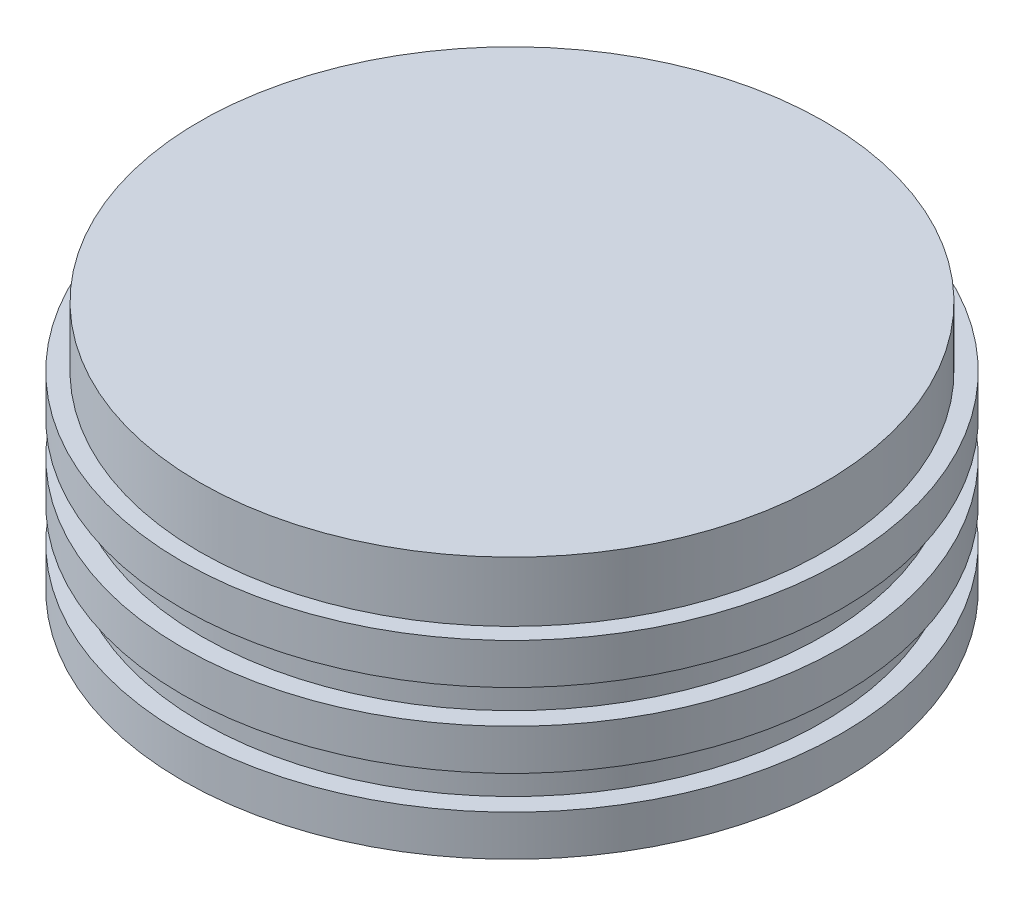
ISO-10303-21;
HEADER;
FILE_DESCRIPTION(('STEP AP214'),'2;1');
FILE_NAME('part.step','',(''),(''),'','','');
FILE_SCHEMA(('AUTOMOTIVE_DESIGN { 1 0 10303 214 1 1 1 1 }'));
ENDSEC;
DATA;
#1=APPLICATION_CONTEXT('core data for automotive mechanical design processes');
#2=APPLICATION_PROTOCOL_DEFINITION('international standard','automotive_design',2000,#1);
#3=PRODUCT_CONTEXT('',#1,'mechanical');
#4=PRODUCT('Part','Part','',(#3));
#5=PRODUCT_RELATED_PRODUCT_CATEGORY('part','',(#4));
#6=PRODUCT_DEFINITION_FORMATION('','',#4);
#7=PRODUCT_DEFINITION_CONTEXT('part definition',#1,'design');
#8=PRODUCT_DEFINITION('design','',#6,#7);
#9=PRODUCT_DEFINITION_SHAPE('','',#8);
#10=(LENGTH_UNIT() NAMED_UNIT(*) SI_UNIT(.MILLI.,.METRE.));
#11=(NAMED_UNIT(*) PLANE_ANGLE_UNIT() SI_UNIT($,.RADIAN.));
#12=(NAMED_UNIT(*) SI_UNIT($,.STERADIAN.) SOLID_ANGLE_UNIT());
#13=UNCERTAINTY_MEASURE_WITH_UNIT(LENGTH_MEASURE(1.E-05),#10,'distance_accuracy_value','');
#14=(GEOMETRIC_REPRESENTATION_CONTEXT(3) GLOBAL_UNCERTAINTY_ASSIGNED_CONTEXT((#13)) GLOBAL_UNIT_ASSIGNED_CONTEXT((#10,
#11,#12)) REPRESENTATION_CONTEXT('',''));
#15=CARTESIAN_POINT('',(0.,0.,0.));
#16=DIRECTION('',(0.,0.,1.));
#17=DIRECTION('',(1.,0.,0.));
#18=AXIS2_PLACEMENT_3D('',#15,#16,#17);
#19=CARTESIAN_POINT('',(-34.8996,0.,0.));
#20=DIRECTION('',(0.,1.,0.));
#21=DIRECTION('',(0.,0.,1.));
#22=AXIS2_PLACEMENT_3D('',#19,#20,#21);
#23=PLANE('',#22);
#24=CARTESIAN_POINT('',(0.,0.,0.));
#25=DIRECTION('',(0.,-1.,0.));
#26=DIRECTION('',(0.,0.,-1.));
#27=AXIS2_PLACEMENT_3D('',#24,#25,#26);
#28=CIRCLE('',#27,3.96875);
#29=CARTESIAN_POINT('',(0.,0.,-3.96875));
#30=VERTEX_POINT('',#29);
#31=EDGE_CURVE('E58',#30,#30,#28,.T.);
#32=ORIENTED_EDGE('',*,*,#31,.F.);
#33=EDGE_LOOP('',(#32));
#34=FACE_BOUND('',#33,.T.);
#35=CARTESIAN_POINT('',(0.,0.,0.));
#36=DIRECTION('',(0.,-1.,0.));
#37=DIRECTION('',(0.,0.,-1.));
#38=AXIS2_PLACEMENT_3D('',#35,#36,#37);
#39=CIRCLE('',#38,34.8996);
#40=CARTESIAN_POINT('',(0.,0.,-34.8996));
#41=VERTEX_POINT('',#40);
#42=EDGE_CURVE('E57',#41,#41,#39,.T.);
#43=ORIENTED_EDGE('',*,*,#42,.T.);
#44=EDGE_LOOP('',(#43));
#45=FACE_BOUND('',#44,.T.);
#46=ADVANCED_FACE('F38',(#34,#45),#23,.F.);
#47=CARTESIAN_POINT('',(0.,26.416,0.));
#48=DIRECTION('',(0.,-1.,0.));
#49=DIRECTION('',(0.,0.,-1.));
#50=AXIS2_PLACEMENT_3D('',#47,#48,#49);
#51=PLANE('',#50);
#52=CARTESIAN_POINT('',(0.,26.416,0.));
#53=DIRECTION('',(0.,-1.,0.));
#54=DIRECTION('',(0.,0.,-1.));
#55=AXIS2_PLACEMENT_3D('',#52,#53,#54);
#56=CIRCLE('',#55,33.0835);
#57=CARTESIAN_POINT('',(0.,26.416,-33.0835));
#58=VERTEX_POINT('',#57);
#59=EDGE_CURVE('E11',#58,#58,#56,.T.);
#60=ORIENTED_EDGE('',*,*,#59,.F.);
#61=EDGE_LOOP('',(#60));
#62=FACE_BOUND('',#61,.T.);
#63=ADVANCED_FACE('F99',(#62),#51,.F.);
#64=CARTESIAN_POINT('',(0.,0.,0.));
#65=DIRECTION('',(0.,-1.,0.));
#66=DIRECTION('',(0.,0.,-1.));
#67=AXIS2_PLACEMENT_3D('',#64,#65,#66);
#68=CYLINDRICAL_SURFACE('',#67,33.0835);
#69=CARTESIAN_POINT('',(0.,20.066,0.));
#70=DIRECTION('',(0.,-1.,0.));
#71=DIRECTION('',(0.,0.,-1.));
#72=AXIS2_PLACEMENT_3D('',#69,#70,#71);
#73=CIRCLE('',#72,33.0835);
#74=CARTESIAN_POINT('',(0.,20.066,-33.0835));
#75=VERTEX_POINT('',#74);
#76=EDGE_CURVE('E44',#75,#75,#73,.T.);
#77=ORIENTED_EDGE('',*,*,#76,.F.);
#78=EDGE_LOOP('',(#77));
#79=FACE_BOUND('',#78,.T.);
#80=ORIENTED_EDGE('',*,*,#59,.T.);
#81=EDGE_LOOP('',(#80));
#82=FACE_BOUND('',#81,.T.);
#83=ADVANCED_FACE('F96',(#79,#82),#68,.T.);
#84=CARTESIAN_POINT('',(-33.0835,20.066,0.));
#85=DIRECTION('',(0.,-1.,0.));
#86=DIRECTION('',(0.,0.,-1.));
#87=AXIS2_PLACEMENT_3D('',#84,#85,#86);
#88=PLANE('',#87);
#89=CARTESIAN_POINT('',(0.,20.066,0.));
#90=DIRECTION('',(0.,-1.,0.));
#91=DIRECTION('',(0.,0.,-1.));
#92=AXIS2_PLACEMENT_3D('',#89,#90,#91);
#93=CIRCLE('',#92,34.8996);
#94=CARTESIAN_POINT('',(0.,20.066,-34.8996));
#95=VERTEX_POINT('',#94);
#96=EDGE_CURVE('E89',#95,#95,#93,.T.);
#97=ORIENTED_EDGE('',*,*,#96,.F.);
#98=EDGE_LOOP('',(#97));
#99=FACE_BOUND('',#98,.T.);
#100=ORIENTED_EDGE('',*,*,#76,.T.);
#101=EDGE_LOOP('',(#100));
#102=FACE_BOUND('',#101,.T.);
#103=ADVANCED_FACE('F94',(#99,#102),#88,.F.);
#104=CARTESIAN_POINT('',(0.,0.,0.));
#105=DIRECTION('',(0.,-1.,0.));
#106=DIRECTION('',(0.,0.,-1.));
#107=AXIS2_PLACEMENT_3D('',#104,#105,#106);
#108=CYLINDRICAL_SURFACE('',#107,34.8996);
#109=CARTESIAN_POINT('',(0.,15.748,0.));
#110=DIRECTION('',(0.,-1.,0.));
#111=DIRECTION('',(0.,0.,-1.));
#112=AXIS2_PLACEMENT_3D('',#109,#110,#111);
#113=CIRCLE('',#112,34.8996);
#114=CARTESIAN_POINT('',(0.,15.748,-34.8996));
#115=VERTEX_POINT('',#114);
#116=EDGE_CURVE('E86',#115,#115,#113,.T.);
#117=ORIENTED_EDGE('',*,*,#116,.F.);
#118=EDGE_LOOP('',(#117));
#119=FACE_BOUND('',#118,.T.);
#120=ORIENTED_EDGE('',*,*,#96,.T.);
#121=EDGE_LOOP('',(#120));
#122=FACE_BOUND('',#121,.T.);
#123=ADVANCED_FACE('F111',(#119,#122),#108,.T.);
#124=CARTESIAN_POINT('',(-34.8996,15.748,0.));
#125=DIRECTION('',(0.,1.,0.));
#126=DIRECTION('',(0.,0.,1.));
#127=AXIS2_PLACEMENT_3D('',#124,#125,#126);
#128=PLANE('',#127);
#129=CARTESIAN_POINT('',(0.,15.748,0.));
#130=DIRECTION('',(0.,-1.,0.));
#131=DIRECTION('',(0.,0.,-1.));
#132=AXIS2_PLACEMENT_3D('',#129,#130,#131);
#133=CIRCLE('',#132,32.8676);
#134=CARTESIAN_POINT('',(0.,15.748,-32.8676));
#135=VERTEX_POINT('',#134);
#136=EDGE_CURVE('E83',#135,#135,#133,.T.);
#137=ORIENTED_EDGE('',*,*,#136,.F.);
#138=EDGE_LOOP('',(#137));
#139=FACE_BOUND('',#138,.T.);
#140=ORIENTED_EDGE('',*,*,#116,.T.);
#141=EDGE_LOOP('',(#140));
#142=FACE_BOUND('',#141,.T.);
#143=ADVANCED_FACE('F115',(#139,#142),#128,.F.);
#144=CARTESIAN_POINT('',(0.,0.,0.));
#145=DIRECTION('',(0.,-1.,0.));
#146=DIRECTION('',(0.,0.,-1.));
#147=AXIS2_PLACEMENT_3D('',#144,#145,#146);
#148=CYLINDRICAL_SURFACE('',#147,32.8676);
#149=CARTESIAN_POINT('',(0.,12.192,0.));
#150=DIRECTION('',(0.,-1.,0.));
#151=DIRECTION('',(0.,0.,-1.));
#152=AXIS2_PLACEMENT_3D('',#149,#150,#151);
#153=CIRCLE('',#152,32.8676);
#154=CARTESIAN_POINT('',(0.,12.192,-32.8676));
#155=VERTEX_POINT('',#154);
#156=EDGE_CURVE('E80',#155,#155,#153,.T.);
#157=ORIENTED_EDGE('',*,*,#156,.F.);
#158=EDGE_LOOP('',(#157));
#159=FACE_BOUND('',#158,.T.);
#160=ORIENTED_EDGE('',*,*,#136,.T.);
#161=EDGE_LOOP('',(#160));
#162=FACE_BOUND('',#161,.T.);
#163=ADVANCED_FACE('F119',(#159,#162),#148,.T.);
#164=CARTESIAN_POINT('',(-34.8996,12.192,0.));
#165=DIRECTION('',(0.,-1.,0.));
#166=DIRECTION('',(0.,0.,-1.));
#167=AXIS2_PLACEMENT_3D('',#164,#165,#166);
#168=PLANE('',#167);
#169=CARTESIAN_POINT('',(0.,12.192,0.));
#170=DIRECTION('',(0.,-1.,0.));
#171=DIRECTION('',(0.,0.,-1.));
#172=AXIS2_PLACEMENT_3D('',#169,#170,#171);
#173=CIRCLE('',#172,34.8996);
#174=CARTESIAN_POINT('',(0.,12.192,-34.8996));
#175=VERTEX_POINT('',#174);
#176=EDGE_CURVE('E77',#175,#175,#173,.T.);
#177=ORIENTED_EDGE('',*,*,#176,.F.);
#178=EDGE_LOOP('',(#177));
#179=FACE_BOUND('',#178,.T.);
#180=ORIENTED_EDGE('',*,*,#156,.T.);
#181=EDGE_LOOP('',(#180));
#182=FACE_BOUND('',#181,.T.);
#183=ADVANCED_FACE('F123',(#179,#182),#168,.F.);
#184=CARTESIAN_POINT('',(0.,0.,0.));
#185=DIRECTION('',(0.,-1.,0.));
#186=DIRECTION('',(0.,0.,-1.));
#187=AXIS2_PLACEMENT_3D('',#184,#185,#186);
#188=CYLINDRICAL_SURFACE('',#187,34.8996);
#189=CARTESIAN_POINT('',(0.,7.874,0.));
#190=DIRECTION('',(0.,-1.,0.));
#191=DIRECTION('',(0.,0.,-1.));
#192=AXIS2_PLACEMENT_3D('',#189,#190,#191);
#193=CIRCLE('',#192,34.8996);
#194=CARTESIAN_POINT('',(0.,7.874,-34.8996));
#195=VERTEX_POINT('',#194);
#196=EDGE_CURVE('E74',#195,#195,#193,.T.);
#197=ORIENTED_EDGE('',*,*,#196,.F.);
#198=EDGE_LOOP('',(#197));
#199=FACE_BOUND('',#198,.T.);
#200=ORIENTED_EDGE('',*,*,#176,.T.);
#201=EDGE_LOOP('',(#200));
#202=FACE_BOUND('',#201,.T.);
#203=ADVANCED_FACE('F127',(#199,#202),#188,.T.);
#204=CARTESIAN_POINT('',(-32.8676,7.874,0.));
#205=DIRECTION('',(0.,1.,0.));
#206=DIRECTION('',(0.,0.,1.));
#207=AXIS2_PLACEMENT_3D('',#204,#205,#206);
#208=PLANE('',#207);
#209=CARTESIAN_POINT('',(0.,7.874,0.));
#210=DIRECTION('',(0.,-1.,0.));
#211=DIRECTION('',(0.,0.,-1.));
#212=AXIS2_PLACEMENT_3D('',#209,#210,#211);
#213=CIRCLE('',#212,32.8676);
#214=CARTESIAN_POINT('',(0.,7.874,-32.8676));
#215=VERTEX_POINT('',#214);
#216=EDGE_CURVE('E71',#215,#215,#213,.T.);
#217=ORIENTED_EDGE('',*,*,#216,.F.);
#218=EDGE_LOOP('',(#217));
#219=FACE_BOUND('',#218,.T.);
#220=ORIENTED_EDGE('',*,*,#196,.T.);
#221=EDGE_LOOP('',(#220));
#222=FACE_BOUND('',#221,.T.);
#223=ADVANCED_FACE('F131',(#219,#222),#208,.F.);
#224=CARTESIAN_POINT('',(0.,0.,0.));
#225=DIRECTION('',(0.,-1.,0.));
#226=DIRECTION('',(0.,0.,-1.));
#227=AXIS2_PLACEMENT_3D('',#224,#225,#226);
#228=CYLINDRICAL_SURFACE('',#227,32.8676);
#229=CARTESIAN_POINT('',(0.,4.318,0.));
#230=DIRECTION('',(0.,-1.,0.));
#231=DIRECTION('',(0.,0.,-1.));
#232=AXIS2_PLACEMENT_3D('',#229,#230,#231);
#233=CIRCLE('',#232,32.8676);
#234=CARTESIAN_POINT('',(0.,4.318,-32.8676));
#235=VERTEX_POINT('',#234);
#236=EDGE_CURVE('E68',#235,#235,#233,.T.);
#237=ORIENTED_EDGE('',*,*,#236,.F.);
#238=EDGE_LOOP('',(#237));
#239=FACE_BOUND('',#238,.T.);
#240=ORIENTED_EDGE('',*,*,#216,.T.);
#241=EDGE_LOOP('',(#240));
#242=FACE_BOUND('',#241,.T.);
#243=ADVANCED_FACE('F135',(#239,#242),#228,.T.);
#244=CARTESIAN_POINT('',(-32.8676,4.318,0.));
#245=DIRECTION('',(0.,-1.,0.));
#246=DIRECTION('',(0.,0.,-1.));
#247=AXIS2_PLACEMENT_3D('',#244,#245,#246);
#248=PLANE('',#247);
#249=CARTESIAN_POINT('',(0.,4.318,0.));
#250=DIRECTION('',(0.,-1.,0.));
#251=DIRECTION('',(0.,0.,-1.));
#252=AXIS2_PLACEMENT_3D('',#249,#250,#251);
#253=CIRCLE('',#252,34.8996);
#254=CARTESIAN_POINT('',(0.,4.318,-34.8996));
#255=VERTEX_POINT('',#254);
#256=EDGE_CURVE('E61',#255,#255,#253,.T.);
#257=ORIENTED_EDGE('',*,*,#256,.F.);
#258=EDGE_LOOP('',(#257));
#259=FACE_BOUND('',#258,.T.);
#260=ORIENTED_EDGE('',*,*,#236,.T.);
#261=EDGE_LOOP('',(#260));
#262=FACE_BOUND('',#261,.T.);
#263=ADVANCED_FACE('F139',(#259,#262),#248,.F.);
#264=CARTESIAN_POINT('',(0.,0.,0.));
#265=DIRECTION('',(0.,-1.,0.));
#266=DIRECTION('',(0.,0.,-1.));
#267=AXIS2_PLACEMENT_3D('',#264,#265,#266);
#268=CYLINDRICAL_SURFACE('',#267,34.8996);
#269=ORIENTED_EDGE('',*,*,#42,.F.);
#270=EDGE_LOOP('',(#269));
#271=FACE_BOUND('',#270,.T.);
#272=ORIENTED_EDGE('',*,*,#256,.T.);
#273=EDGE_LOOP('',(#272));
#274=FACE_BOUND('',#273,.T.);
#275=ADVANCED_FACE('F51',(#271,#274),#268,.T.);
#276=CARTESIAN_POINT('',(0.,15.875,0.));
#277=DIRECTION('',(0.,-1.,0.));
#278=DIRECTION('',(0.,0.,-1.));
#279=AXIS2_PLACEMENT_3D('',#276,#277,#278);
#280=CONICAL_SURFACE('',#279,3.96875,1.02974425867665);
#281=CARTESIAN_POINT('',(0.,18.2596655817656,0.));
#282=VERTEX_POINT('',#281);
#283=VERTEX_LOOP('',#282);
#284=FACE_BOUND('',#283,.T.);
#285=CARTESIAN_POINT('',(0.,15.875,0.));
#286=DIRECTION('',(0.,-1.,0.));
#287=DIRECTION('',(0.,0.,-1.));
#288=AXIS2_PLACEMENT_3D('',#285,#286,#287);
#289=CIRCLE('',#288,3.96875);
#290=CARTESIAN_POINT('',(0.,15.875,-3.96875));
#291=VERTEX_POINT('',#290);
#292=EDGE_CURVE('E55',#291,#291,#289,.T.);
#293=ORIENTED_EDGE('',*,*,#292,.T.);
#294=EDGE_LOOP('',(#293));
#295=FACE_BOUND('',#294,.T.);
#296=ADVANCED_FACE('F47',(#284,#295),#280,.F.);
#297=CARTESIAN_POINT('',(0.,0.,0.));
#298=DIRECTION('',(0.,-1.,0.));
#299=DIRECTION('',(0.,0.,-1.));
#300=AXIS2_PLACEMENT_3D('',#297,#298,#299);
#301=CYLINDRICAL_SURFACE('',#300,3.96875);
#302=ORIENTED_EDGE('',*,*,#292,.F.);
#303=EDGE_LOOP('',(#302));
#304=FACE_BOUND('',#303,.T.);
#305=ORIENTED_EDGE('',*,*,#31,.T.);
#306=EDGE_LOOP('',(#305));
#307=FACE_BOUND('',#306,.T.);
#308=ADVANCED_FACE('F50',(#304,#307),#301,.F.);
#309=CLOSED_SHELL('',(#46,#63,#83,#103,#123,#143,#163,#183,#203,#223,#243,#263,#275,#296,#308));
#310=MANIFOLD_SOLID_BREP('B2',#309);
#311=ADVANCED_BREP_SHAPE_REPRESENTATION('',(#18,#310),#14);
#312=SHAPE_DEFINITION_REPRESENTATION(#9,#311);
ENDSEC;
END-ISO-10303-21;
